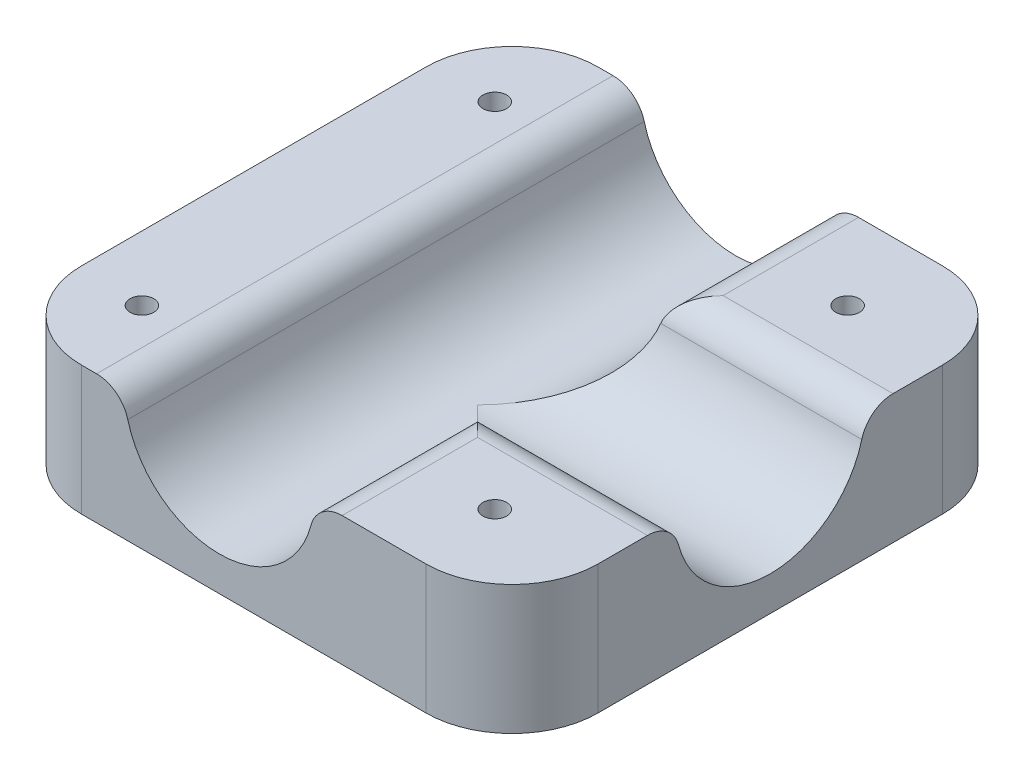
ISO-10303-21;
HEADER;
FILE_DESCRIPTION(('STEP AP214'),'2;1');
FILE_NAME('part.step','',(''),(''),'','','');
FILE_SCHEMA(('AUTOMOTIVE_DESIGN { 1 0 10303 214 1 1 1 1 }'));
ENDSEC;
DATA;
#1=APPLICATION_CONTEXT('core data for automotive mechanical design processes');
#2=APPLICATION_PROTOCOL_DEFINITION('international standard','automotive_design',2000,#1);
#3=PRODUCT_CONTEXT('',#1,'mechanical');
#4=PRODUCT('Part','Part','',(#3));
#5=PRODUCT_RELATED_PRODUCT_CATEGORY('part','',(#4));
#6=PRODUCT_DEFINITION_FORMATION('','',#4);
#7=PRODUCT_DEFINITION_CONTEXT('part definition',#1,'design');
#8=PRODUCT_DEFINITION('design','',#6,#7);
#9=PRODUCT_DEFINITION_SHAPE('','',#8);
#10=(LENGTH_UNIT() NAMED_UNIT(*) SI_UNIT(.MILLI.,.METRE.));
#11=(NAMED_UNIT(*) PLANE_ANGLE_UNIT() SI_UNIT($,.RADIAN.));
#12=(NAMED_UNIT(*) SI_UNIT($,.STERADIAN.) SOLID_ANGLE_UNIT());
#13=UNCERTAINTY_MEASURE_WITH_UNIT(LENGTH_MEASURE(1.E-05),#10,'distance_accuracy_value','');
#14=(GEOMETRIC_REPRESENTATION_CONTEXT(3) GLOBAL_UNCERTAINTY_ASSIGNED_CONTEXT((#13)) GLOBAL_UNIT_ASSIGNED_CONTEXT((#10,
#11,#12)) REPRESENTATION_CONTEXT('',''));
#15=CARTESIAN_POINT('',(0.,0.,0.));
#16=DIRECTION('',(0.,0.,1.));
#17=DIRECTION('',(1.,0.,0.));
#18=AXIS2_PLACEMENT_3D('',#15,#16,#17);
#19=CARTESIAN_POINT('',(0.,19.05,0.));
#20=DIRECTION('',(0.,1.,0.));
#21=DIRECTION('',(0.,0.,1.));
#22=AXIS2_PLACEMENT_3D('',#19,#20,#21);
#23=PLANE('',#22);
#24=DIRECTION('',(1.,0.,0.));
#25=VECTOR('',#24,1.);
#26=CARTESIAN_POINT('',(0.,19.05,0.));
#27=LINE('',#26,#25);
#28=CARTESIAN_POINT('',(51.1369851244626,19.05,0.));
#29=VERTEX_POINT('',#28);
#30=CARTESIAN_POINT('',(63.5,19.05,0.));
#31=VERTEX_POINT('',#30);
#32=EDGE_CURVE('E235',#29,#31,#27,.T.);
#33=ORIENTED_EDGE('',*,*,#32,.T.);
#34=CARTESIAN_POINT('',(63.5,19.05,-12.7));
#35=DIRECTION('',(0.,1.,0.));
#36=DIRECTION('',(0.,0.,1.));
#37=AXIS2_PLACEMENT_3D('',#34,#35,#36);
#38=CIRCLE('',#37,12.7);
#39=CARTESIAN_POINT('',(76.2,19.05,-12.7));
#40=VERTEX_POINT('',#39);
#41=EDGE_CURVE('E11',#31,#40,#38,.T.);
#42=ORIENTED_EDGE('',*,*,#41,.T.);
#43=DIRECTION('',(0.,0.,-1.));
#44=VECTOR('',#43,1.);
#45=CARTESIAN_POINT('',(76.2,19.05,0.));
#46=LINE('',#45,#44);
#47=CARTESIAN_POINT('',(76.2,19.05,-19.9830148755374));
#48=VERTEX_POINT('',#47);
#49=EDGE_CURVE('E240',#40,#48,#46,.T.);
#50=ORIENTED_EDGE('',*,*,#49,.T.);
#51=DIRECTION('',(-1.,0.,0.));
#52=VECTOR('',#51,1.);
#53=CARTESIAN_POINT('',(46.99,19.05,-19.9830148755374));
#54=LINE('',#53,#52);
#55=CARTESIAN_POINT('',(51.1369851244626,19.05,-19.9830148755374));
#56=VERTEX_POINT('',#55);
#57=EDGE_CURVE('E296',#48,#56,#54,.T.);
#58=ORIENTED_EDGE('',*,*,#57,.T.);
#59=DIRECTION('',(0.,0.,-1.));
#60=VECTOR('',#59,1.);
#61=CARTESIAN_POINT('',(51.1369851244626,19.05,0.));
#62=LINE('',#61,#60);
#63=EDGE_CURVE('E299',#56,#29,#62,.F.);
#64=ORIENTED_EDGE('',*,*,#63,.T.);
#65=EDGE_LOOP('',(#33,#42,#50,#58,#64));
#66=FACE_BOUND('',#65,.T.);
#67=CARTESIAN_POINT('',(61.595,19.05,-12.065));
#68=DIRECTION('',(0.,1.,0.));
#69=DIRECTION('',(0.,0.,1.));
#70=AXIS2_PLACEMENT_3D('',#67,#68,#69);
#71=CIRCLE('',#70,1.75);
#72=CARTESIAN_POINT('',(61.595,19.05,-10.315));
#73=VERTEX_POINT('',#72);
#74=EDGE_CURVE('E251',#73,#73,#71,.T.);
#75=ORIENTED_EDGE('',*,*,#74,.F.);
#76=EDGE_LOOP('',(#75));
#77=FACE_BOUND('',#76,.T.);
#78=ADVANCED_FACE('F41',(#66,#77),#23,.T.);
#79=DIRECTION('',(1.,0.,0.));
#80=VECTOR('',#79,1.);
#81=CARTESIAN_POINT('',(0.,19.05,-76.2));
#82=LINE('',#81,#80);
#83=CARTESIAN_POINT('',(12.7,19.05,-76.2));
#84=VERTEX_POINT('',#83);
#85=CARTESIAN_POINT('',(14.9030148755374,19.05,-76.2));
#86=VERTEX_POINT('',#85);
#87=EDGE_CURVE('E244',#84,#86,#82,.T.);
#88=ORIENTED_EDGE('',*,*,#87,.F.);
#89=CARTESIAN_POINT('',(12.7,19.05,-63.5));
#90=DIRECTION('',(0.,1.,0.));
#91=DIRECTION('',(0.,0.,1.));
#92=AXIS2_PLACEMENT_3D('',#89,#90,#91);
#93=CIRCLE('',#92,12.7);
#94=CARTESIAN_POINT('',(0.,19.05,-63.5));
#95=VERTEX_POINT('',#94);
#96=EDGE_CURVE('E381',#84,#95,#93,.T.);
#97=ORIENTED_EDGE('',*,*,#96,.T.);
#98=DIRECTION('',(0.,0.,-1.));
#99=VECTOR('',#98,1.);
#100=CARTESIAN_POINT('',(0.,19.05,0.));
#101=LINE('',#100,#99);
#102=CARTESIAN_POINT('',(0.,19.05,-12.7));
#103=VERTEX_POINT('',#102);
#104=EDGE_CURVE('E247',#103,#95,#101,.T.);
#105=ORIENTED_EDGE('',*,*,#104,.F.);
#106=CARTESIAN_POINT('',(12.7,19.05,-12.7));
#107=DIRECTION('',(0.,1.,0.));
#108=DIRECTION('',(0.,0.,1.));
#109=AXIS2_PLACEMENT_3D('',#106,#107,#108);
#110=CIRCLE('',#109,12.7);
#111=CARTESIAN_POINT('',(12.7,19.05,0.));
#112=VERTEX_POINT('',#111);
#113=EDGE_CURVE('E70',#103,#112,#110,.T.);
#114=ORIENTED_EDGE('',*,*,#113,.T.);
#115=CARTESIAN_POINT('',(14.9030148755374,19.05,0.));
#116=VERTEX_POINT('',#115);
#117=EDGE_CURVE('E236',#112,#116,#27,.T.);
#118=ORIENTED_EDGE('',*,*,#117,.T.);
#119=DIRECTION('',(0.,0.,-1.));
#120=VECTOR('',#119,1.);
#121=CARTESIAN_POINT('',(14.9030148755374,19.05,-76.2));
#122=LINE('',#121,#120);
#123=EDGE_CURVE('E334',#116,#86,#122,.T.);
#124=ORIENTED_EDGE('',*,*,#123,.T.);
#125=EDGE_LOOP('',(#88,#97,#105,#114,#118,#124));
#126=FACE_BOUND('',#125,.T.);
#127=CARTESIAN_POINT('',(9.525,19.05,-64.135));
#128=DIRECTION('',(0.,1.,0.));
#129=DIRECTION('',(0.,0.,1.));
#130=AXIS2_PLACEMENT_3D('',#127,#128,#129);
#131=CIRCLE('',#130,1.75);
#132=CARTESIAN_POINT('',(9.525,19.05,-62.385));
#133=VERTEX_POINT('',#132);
#134=EDGE_CURVE('E230',#133,#133,#131,.T.);
#135=ORIENTED_EDGE('',*,*,#134,.F.);
#136=EDGE_LOOP('',(#135));
#137=FACE_BOUND('',#136,.T.);
#138=CARTESIAN_POINT('',(9.525,19.05,-12.065));
#139=DIRECTION('',(0.,1.,0.));
#140=DIRECTION('',(0.,0.,1.));
#141=AXIS2_PLACEMENT_3D('',#138,#139,#140);
#142=CIRCLE('',#141,1.75);
#143=CARTESIAN_POINT('',(9.525,19.05,-10.315));
#144=VERTEX_POINT('',#143);
#145=EDGE_CURVE('E226',#144,#144,#142,.T.);
#146=ORIENTED_EDGE('',*,*,#145,.F.);
#147=EDGE_LOOP('',(#146));
#148=FACE_BOUND('',#147,.T.);
#149=ADVANCED_FACE('F437',(#126,#137,#148),#23,.T.);
#150=CARTESIAN_POINT('',(0.,19.05,0.));
#151=DIRECTION('',(0.,0.,-1.));
#152=DIRECTION('',(-1.,0.,0.));
#153=AXIS2_PLACEMENT_3D('',#150,#151,#152);
#154=PLANE('',#153);
#155=ORIENTED_EDGE('',*,*,#117,.F.);
#156=DIRECTION('',(0.,-1.,0.));
#157=VECTOR('',#156,1.);
#158=CARTESIAN_POINT('',(12.7,0.,0.));
#159=LINE('',#158,#157);
#160=CARTESIAN_POINT('',(12.7,0.,0.));
#161=VERTEX_POINT('',#160);
#162=EDGE_CURVE('E50',#112,#161,#159,.T.);
#163=ORIENTED_EDGE('',*,*,#162,.T.);
#164=DIRECTION('',(1.,0.,0.));
#165=VECTOR('',#164,1.);
#166=CARTESIAN_POINT('',(0.,0.,0.));
#167=LINE('',#166,#165);
#168=CARTESIAN_POINT('',(63.5,0.,0.));
#169=VERTEX_POINT('',#168);
#170=EDGE_CURVE('E267',#161,#169,#167,.T.);
#171=ORIENTED_EDGE('',*,*,#170,.T.);
#172=DIRECTION('',(0.,-1.,0.));
#173=VECTOR('',#172,1.);
#174=CARTESIAN_POINT('',(63.5,19.05,0.));
#175=LINE('',#174,#173);
#176=EDGE_CURVE('E59',#169,#31,#175,.F.);
#177=ORIENTED_EDGE('',*,*,#176,.T.);
#178=ORIENTED_EDGE('',*,*,#32,.F.);
#179=CARTESIAN_POINT('',(51.1369851244626,14.2875,0.));
#180=DIRECTION('',(0.,0.,-1.));
#181=DIRECTION('',(-1.,0.,0.));
#182=AXIS2_PLACEMENT_3D('',#179,#180,#181);
#183=CIRCLE('',#182,4.7625);
#184=CARTESIAN_POINT('',(46.5309719572264,15.4983050847458,0.));
#185=VERTEX_POINT('',#184);
#186=EDGE_CURVE('E306',#29,#185,#183,.F.);
#187=ORIENTED_EDGE('',*,*,#186,.T.);
#188=CARTESIAN_POINT('',(33.02,19.05,0.));
#189=DIRECTION('',(0.,0.,1.));
#190=DIRECTION('',(1.,0.,0.));
#191=AXIS2_PLACEMENT_3D('',#188,#189,#190);
#192=CIRCLE('',#191,13.97);
#193=CARTESIAN_POINT('',(19.5090280427736,15.4983050847458,0.));
#194=VERTEX_POINT('',#193);
#195=EDGE_CURVE('E203',#194,#185,#192,.T.);
#196=ORIENTED_EDGE('',*,*,#195,.F.);
#197=CARTESIAN_POINT('',(14.9030148755374,14.2875,0.));
#198=DIRECTION('',(0.,0.,-1.));
#199=DIRECTION('',(-1.,0.,0.));
#200=AXIS2_PLACEMENT_3D('',#197,#198,#199);
#201=CIRCLE('',#200,4.7625);
#202=EDGE_CURVE('E302',#194,#116,#201,.F.);
#203=ORIENTED_EDGE('',*,*,#202,.T.);
#204=EDGE_LOOP('',(#155,#163,#171,#177,#178,#187,#196,#203));
#205=FACE_BOUND('',#204,.T.);
#206=ADVANCED_FACE('F389',(#205),#154,.F.);
#207=CARTESIAN_POINT('',(76.2,19.05,0.));
#208=DIRECTION('',(-1.,0.,0.));
#209=DIRECTION('',(0.,0.,1.));
#210=AXIS2_PLACEMENT_3D('',#207,#208,#209);
#211=PLANE('',#210);
#212=DIRECTION('',(0.,0.,-1.));
#213=VECTOR('',#212,1.);
#214=CARTESIAN_POINT('',(76.2,0.,0.));
#215=LINE('',#214,#213);
#216=CARTESIAN_POINT('',(76.2,0.,-12.7));
#217=VERTEX_POINT('',#216);
#218=CARTESIAN_POINT('',(76.2,0.,-63.5));
#219=VERTEX_POINT('',#218);
#220=EDGE_CURVE('E270',#217,#219,#215,.T.);
#221=ORIENTED_EDGE('',*,*,#220,.T.);
#222=DIRECTION('',(0.,-1.,0.));
#223=VECTOR('',#222,1.);
#224=CARTESIAN_POINT('',(76.2,19.05,-63.5));
#225=LINE('',#224,#223);
#226=CARTESIAN_POINT('',(76.2,19.05,-63.5));
#227=VERTEX_POINT('',#226);
#228=EDGE_CURVE('E367',#219,#227,#225,.F.);
#229=ORIENTED_EDGE('',*,*,#228,.T.);
#230=CARTESIAN_POINT('',(76.2,19.05,-56.2169851244626));
#231=VERTEX_POINT('',#230);
#232=EDGE_CURVE('E239',#231,#227,#46,.T.);
#233=ORIENTED_EDGE('',*,*,#232,.F.);
#234=CARTESIAN_POINT('',(76.2,14.2875,-56.2169851244626));
#235=DIRECTION('',(-1.,0.,0.));
#236=DIRECTION('',(0.,0.,1.));
#237=AXIS2_PLACEMENT_3D('',#234,#235,#236);
#238=CIRCLE('',#237,4.7625);
#239=CARTESIAN_POINT('',(76.2,15.4983050847458,-51.6109719572264));
#240=VERTEX_POINT('',#239);
#241=EDGE_CURVE('E314',#231,#240,#238,.F.);
#242=ORIENTED_EDGE('',*,*,#241,.T.);
#243=CARTESIAN_POINT('',(76.2,19.05,-38.1));
#244=DIRECTION('',(1.,0.,0.));
#245=DIRECTION('',(0.,0.,-1.));
#246=AXIS2_PLACEMENT_3D('',#243,#244,#245);
#247=CIRCLE('',#246,13.97);
#248=CARTESIAN_POINT('',(76.2,15.4983050847458,-24.5890280427736));
#249=VERTEX_POINT('',#248);
#250=EDGE_CURVE('E211',#249,#240,#247,.T.);
#251=ORIENTED_EDGE('',*,*,#250,.F.);
#252=CARTESIAN_POINT('',(76.2,14.2875,-19.9830148755374));
#253=DIRECTION('',(-1.,0.,0.));
#254=DIRECTION('',(0.,0.,1.));
#255=AXIS2_PLACEMENT_3D('',#252,#253,#254);
#256=CIRCLE('',#255,4.7625);
#257=EDGE_CURVE('E317',#249,#48,#256,.F.);
#258=ORIENTED_EDGE('',*,*,#257,.T.);
#259=ORIENTED_EDGE('',*,*,#49,.F.);
#260=DIRECTION('',(0.,-1.,0.));
#261=VECTOR('',#260,1.);
#262=CARTESIAN_POINT('',(76.2,19.05,-12.7));
#263=LINE('',#262,#261);
#264=EDGE_CURVE('E363',#40,#217,#263,.T.);
#265=ORIENTED_EDGE('',*,*,#264,.T.);
#266=EDGE_LOOP('',(#221,#229,#233,#242,#251,#258,#259,#265));
#267=FACE_BOUND('',#266,.T.);
#268=ADVANCED_FACE('F401',(#267),#211,.F.);
#269=CARTESIAN_POINT('',(0.,19.05,-76.2));
#270=DIRECTION('',(0.,0.,-1.));
#271=DIRECTION('',(-1.,0.,0.));
#272=AXIS2_PLACEMENT_3D('',#269,#270,#271);
#273=PLANE('',#272);
#274=CARTESIAN_POINT('',(51.1369851244626,19.05,-76.2));
#275=VERTEX_POINT('',#274);
#276=CARTESIAN_POINT('',(63.5,19.05,-76.2));
#277=VERTEX_POINT('',#276);
#278=EDGE_CURVE('E243',#275,#277,#82,.T.);
#279=ORIENTED_EDGE('',*,*,#278,.T.);
#280=DIRECTION('',(0.,-1.,0.));
#281=VECTOR('',#280,1.);
#282=CARTESIAN_POINT('',(63.5,0.,-76.2));
#283=LINE('',#282,#281);
#284=CARTESIAN_POINT('',(63.5,0.,-76.2));
#285=VERTEX_POINT('',#284);
#286=EDGE_CURVE('E347',#277,#285,#283,.T.);
#287=ORIENTED_EDGE('',*,*,#286,.T.);
#288=DIRECTION('',(1.,0.,0.));
#289=VECTOR('',#288,1.);
#290=CARTESIAN_POINT('',(0.,0.,-76.2));
#291=LINE('',#290,#289);
#292=CARTESIAN_POINT('',(12.7,0.,-76.2));
#293=VERTEX_POINT('',#292);
#294=EDGE_CURVE('E274',#293,#285,#291,.T.);
#295=ORIENTED_EDGE('',*,*,#294,.F.);
#296=DIRECTION('',(0.,-1.,0.));
#297=VECTOR('',#296,1.);
#298=CARTESIAN_POINT('',(12.7,19.05,-76.2));
#299=LINE('',#298,#297);
#300=EDGE_CURVE('E338',#293,#84,#299,.F.);
#301=ORIENTED_EDGE('',*,*,#300,.T.);
#302=ORIENTED_EDGE('',*,*,#87,.T.);
#303=CARTESIAN_POINT('',(14.9030148755374,14.2875,-76.2));
#304=DIRECTION('',(0.,0.,-1.));
#305=DIRECTION('',(-1.,0.,0.));
#306=AXIS2_PLACEMENT_3D('',#303,#304,#305);
#307=CIRCLE('',#306,4.7625);
#308=CARTESIAN_POINT('',(19.5090280427736,15.4983050847458,-76.2));
#309=VERTEX_POINT('',#308);
#310=EDGE_CURVE('E328',#86,#309,#307,.T.);
#311=ORIENTED_EDGE('',*,*,#310,.T.);
#312=CARTESIAN_POINT('',(33.02,19.05,-76.2));
#313=DIRECTION('',(0.,0.,1.));
#314=DIRECTION('',(1.,0.,0.));
#315=AXIS2_PLACEMENT_3D('',#312,#313,#314);
#316=CIRCLE('',#315,13.97);
#317=CARTESIAN_POINT('',(46.5309719572264,15.4983050847458,-76.2));
#318=VERTEX_POINT('',#317);
#319=EDGE_CURVE('E219',#309,#318,#316,.T.);
#320=ORIENTED_EDGE('',*,*,#319,.T.);
#321=CARTESIAN_POINT('',(51.1369851244626,14.2875,-76.2));
#322=DIRECTION('',(0.,0.,-1.));
#323=DIRECTION('',(-1.,0.,0.));
#324=AXIS2_PLACEMENT_3D('',#321,#322,#323);
#325=CIRCLE('',#324,4.7625);
#326=EDGE_CURVE('E331',#318,#275,#325,.T.);
#327=ORIENTED_EDGE('',*,*,#326,.T.);
#328=EDGE_LOOP('',(#279,#287,#295,#301,#302,#311,#320,#327));
#329=FACE_BOUND('',#328,.T.);
#330=ADVANCED_FACE('F427',(#329),#273,.T.);
#331=CARTESIAN_POINT('',(61.595,19.05,-12.065));
#332=DIRECTION('',(0.,-1.,0.));
#333=DIRECTION('',(0.,0.,-1.));
#334=AXIS2_PLACEMENT_3D('',#331,#332,#333);
#335=CYLINDRICAL_SURFACE('',#334,1.75);
#336=ORIENTED_EDGE('',*,*,#74,.T.);
#337=EDGE_LOOP('',(#336));
#338=FACE_BOUND('',#337,.T.);
#339=CARTESIAN_POINT('',(61.595,0.,-12.065));
#340=DIRECTION('',(0.,1.,0.));
#341=DIRECTION('',(0.,0.,1.));
#342=AXIS2_PLACEMENT_3D('',#339,#340,#341);
#343=CIRCLE('',#342,1.75);
#344=CARTESIAN_POINT('',(61.595,0.,-10.315));
#345=VERTEX_POINT('',#344);
#346=EDGE_CURVE('E282',#345,#345,#343,.T.);
#347=ORIENTED_EDGE('',*,*,#346,.F.);
#348=EDGE_LOOP('',(#347));
#349=FACE_BOUND('',#348,.T.);
#350=ADVANCED_FACE('F471',(#338,#349),#335,.F.);
#351=CARTESIAN_POINT('',(0.,19.05,0.));
#352=DIRECTION('',(-1.,0.,0.));
#353=DIRECTION('',(0.,0.,1.));
#354=AXIS2_PLACEMENT_3D('',#351,#352,#353);
#355=PLANE('',#354);
#356=ORIENTED_EDGE('',*,*,#104,.T.);
#357=DIRECTION('',(0.,-1.,0.));
#358=VECTOR('',#357,1.);
#359=CARTESIAN_POINT('',(0.,19.05,-63.5));
#360=LINE('',#359,#358);
#361=CARTESIAN_POINT('',(0.,0.,-63.5));
#362=VERTEX_POINT('',#361);
#363=EDGE_CURVE('E376',#95,#362,#360,.T.);
#364=ORIENTED_EDGE('',*,*,#363,.T.);
#365=DIRECTION('',(0.,0.,-1.));
#366=VECTOR('',#365,1.);
#367=CARTESIAN_POINT('',(0.,0.,0.));
#368=LINE('',#367,#366);
#369=CARTESIAN_POINT('',(0.,0.,-12.7));
#370=VERTEX_POINT('',#369);
#371=EDGE_CURVE('E278',#370,#362,#368,.T.);
#372=ORIENTED_EDGE('',*,*,#371,.F.);
#373=DIRECTION('',(0.,-1.,0.));
#374=VECTOR('',#373,1.);
#375=CARTESIAN_POINT('',(0.,19.05,-12.7));
#376=LINE('',#375,#374);
#377=EDGE_CURVE('E373',#370,#103,#376,.F.);
#378=ORIENTED_EDGE('',*,*,#377,.T.);
#379=EDGE_LOOP('',(#356,#364,#372,#378));
#380=FACE_BOUND('',#379,.T.);
#381=ADVANCED_FACE('F434',(#380),#355,.T.);
#382=CARTESIAN_POINT('',(9.525,19.05,-64.135));
#383=DIRECTION('',(0.,-1.,0.));
#384=DIRECTION('',(0.,0.,-1.));
#385=AXIS2_PLACEMENT_3D('',#382,#383,#384);
#386=CYLINDRICAL_SURFACE('',#385,1.75);
#387=ORIENTED_EDGE('',*,*,#134,.T.);
#388=EDGE_LOOP('',(#387));
#389=FACE_BOUND('',#388,.T.);
#390=CARTESIAN_POINT('',(9.525,0.,-64.135));
#391=DIRECTION('',(0.,1.,0.));
#392=DIRECTION('',(0.,0.,1.));
#393=AXIS2_PLACEMENT_3D('',#390,#391,#392);
#394=CIRCLE('',#393,1.75);
#395=CARTESIAN_POINT('',(9.525,0.,-62.385));
#396=VERTEX_POINT('',#395);
#397=EDGE_CURVE('E263',#396,#396,#394,.T.);
#398=ORIENTED_EDGE('',*,*,#397,.F.);
#399=EDGE_LOOP('',(#398));
#400=FACE_BOUND('',#399,.T.);
#401=ADVANCED_FACE('F466',(#389,#400),#386,.F.);
#402=CARTESIAN_POINT('',(9.525,19.05,-12.065));
#403=DIRECTION('',(0.,-1.,0.));
#404=DIRECTION('',(0.,0.,-1.));
#405=AXIS2_PLACEMENT_3D('',#402,#403,#404);
#406=CYLINDRICAL_SURFACE('',#405,1.75);
#407=ORIENTED_EDGE('',*,*,#145,.T.);
#408=EDGE_LOOP('',(#407));
#409=FACE_BOUND('',#408,.T.);
#410=CARTESIAN_POINT('',(9.525,0.,-12.065));
#411=DIRECTION('',(0.,1.,0.));
#412=DIRECTION('',(0.,0.,1.));
#413=AXIS2_PLACEMENT_3D('',#410,#411,#412);
#414=CIRCLE('',#413,1.75);
#415=CARTESIAN_POINT('',(9.525,0.,-10.315));
#416=VERTEX_POINT('',#415);
#417=EDGE_CURVE('E223',#416,#416,#414,.T.);
#418=ORIENTED_EDGE('',*,*,#417,.F.);
#419=EDGE_LOOP('',(#418));
#420=FACE_BOUND('',#419,.T.);
#421=ADVANCED_FACE('F460',(#409,#420),#406,.F.);
#422=CARTESIAN_POINT('',(61.595,19.05,-64.135));
#423=DIRECTION('',(0.,-1.,0.));
#424=DIRECTION('',(0.,0.,-1.));
#425=AXIS2_PLACEMENT_3D('',#422,#423,#424);
#426=CYLINDRICAL_SURFACE('',#425,1.74999999999999);
#427=CARTESIAN_POINT('',(61.595,19.05,-64.135));
#428=DIRECTION('',(0.,1.,0.));
#429=DIRECTION('',(0.,0.,1.));
#430=AXIS2_PLACEMENT_3D('',#427,#428,#429);
#431=CIRCLE('',#430,1.74999999999999);
#432=CARTESIAN_POINT('',(61.595,19.05,-62.385));
#433=VERTEX_POINT('',#432);
#434=EDGE_CURVE('E255',#433,#433,#431,.T.);
#435=ORIENTED_EDGE('',*,*,#434,.T.);
#436=EDGE_LOOP('',(#435));
#437=FACE_BOUND('',#436,.T.);
#438=CARTESIAN_POINT('',(61.595,0.,-64.135));
#439=DIRECTION('',(0.,1.,0.));
#440=DIRECTION('',(0.,0.,1.));
#441=AXIS2_PLACEMENT_3D('',#438,#439,#440);
#442=CIRCLE('',#441,1.74999999999999);
#443=CARTESIAN_POINT('',(61.595,0.,-62.385));
#444=VERTEX_POINT('',#443);
#445=EDGE_CURVE('E231',#444,#444,#442,.T.);
#446=ORIENTED_EDGE('',*,*,#445,.F.);
#447=EDGE_LOOP('',(#446));
#448=FACE_BOUND('',#447,.T.);
#449=ADVANCED_FACE('F454',(#437,#448),#426,.F.);
#450=ORIENTED_EDGE('',*,*,#232,.T.);
#451=CARTESIAN_POINT('',(63.5,19.05,-63.5));
#452=DIRECTION('',(0.,1.,0.));
#453=DIRECTION('',(0.,0.,1.));
#454=AXIS2_PLACEMENT_3D('',#451,#452,#453);
#455=CIRCLE('',#454,12.7);
#456=EDGE_CURVE('E370',#227,#277,#455,.T.);
#457=ORIENTED_EDGE('',*,*,#456,.T.);
#458=ORIENTED_EDGE('',*,*,#278,.F.);
#459=DIRECTION('',(0.,0.,-1.));
#460=VECTOR('',#459,1.);
#461=CARTESIAN_POINT('',(51.1369851244626,19.05,-52.07));
#462=LINE('',#461,#460);
#463=CARTESIAN_POINT('',(51.1369851244626,19.05,-56.2169851244626));
#464=VERTEX_POINT('',#463);
#465=EDGE_CURVE('E321',#275,#464,#462,.F.);
#466=ORIENTED_EDGE('',*,*,#465,.T.);
#467=DIRECTION('',(-1.,0.,0.));
#468=VECTOR('',#467,1.);
#469=CARTESIAN_POINT('',(76.2,19.05,-56.2169851244626));
#470=LINE('',#469,#468);
#471=EDGE_CURVE('E324',#464,#231,#470,.F.);
#472=ORIENTED_EDGE('',*,*,#471,.T.);
#473=EDGE_LOOP('',(#450,#457,#458,#466,#472));
#474=FACE_BOUND('',#473,.T.);
#475=ORIENTED_EDGE('',*,*,#434,.F.);
#476=EDGE_LOOP('',(#475));
#477=FACE_BOUND('',#476,.T.);
#478=ADVANCED_FACE('F418',(#474,#477),#23,.T.);
#479=CARTESIAN_POINT('',(0.,0.,0.));
#480=DIRECTION('',(0.,1.,0.));
#481=DIRECTION('',(0.,0.,1.));
#482=AXIS2_PLACEMENT_3D('',#479,#480,#481);
#483=PLANE('',#482);
#484=ORIENTED_EDGE('',*,*,#417,.T.);
#485=EDGE_LOOP('',(#484));
#486=FACE_BOUND('',#485,.T.);
#487=ORIENTED_EDGE('',*,*,#397,.T.);
#488=EDGE_LOOP('',(#487));
#489=FACE_BOUND('',#488,.T.);
#490=ORIENTED_EDGE('',*,*,#294,.T.);
#491=CARTESIAN_POINT('',(63.5,0.,-63.5));
#492=DIRECTION('',(0.,1.,0.));
#493=DIRECTION('',(0.,0.,1.));
#494=AXIS2_PLACEMENT_3D('',#491,#492,#493);
#495=CIRCLE('',#494,12.7);
#496=EDGE_CURVE('E360',#285,#219,#495,.F.);
#497=ORIENTED_EDGE('',*,*,#496,.T.);
#498=ORIENTED_EDGE('',*,*,#220,.F.);
#499=CARTESIAN_POINT('',(63.5,0.,-12.7));
#500=DIRECTION('',(0.,1.,0.));
#501=DIRECTION('',(0.,0.,1.));
#502=AXIS2_PLACEMENT_3D('',#499,#500,#501);
#503=CIRCLE('',#502,12.7);
#504=EDGE_CURVE('E351',#217,#169,#503,.F.);
#505=ORIENTED_EDGE('',*,*,#504,.T.);
#506=ORIENTED_EDGE('',*,*,#170,.F.);
#507=CARTESIAN_POINT('',(12.7,0.,-12.7));
#508=DIRECTION('',(0.,1.,0.));
#509=DIRECTION('',(0.,0.,1.));
#510=AXIS2_PLACEMENT_3D('',#507,#508,#509);
#511=CIRCLE('',#510,12.7);
#512=EDGE_CURVE('E354',#161,#370,#511,.F.);
#513=ORIENTED_EDGE('',*,*,#512,.T.);
#514=ORIENTED_EDGE('',*,*,#371,.T.);
#515=CARTESIAN_POINT('',(12.7,0.,-63.5));
#516=DIRECTION('',(0.,1.,0.));
#517=DIRECTION('',(0.,0.,1.));
#518=AXIS2_PLACEMENT_3D('',#515,#516,#517);
#519=CIRCLE('',#518,12.7);
#520=EDGE_CURVE('E357',#362,#293,#519,.F.);
#521=ORIENTED_EDGE('',*,*,#520,.T.);
#522=EDGE_LOOP('',(#490,#497,#498,#505,#506,#513,#514,#521));
#523=FACE_BOUND('',#522,.T.);
#524=ORIENTED_EDGE('',*,*,#346,.T.);
#525=EDGE_LOOP('',(#524));
#526=FACE_BOUND('',#525,.T.);
#527=ORIENTED_EDGE('',*,*,#445,.T.);
#528=EDGE_LOOP('',(#527));
#529=FACE_BOUND('',#528,.T.);
#530=ADVANCED_FACE('F392',(#486,#489,#523,#526,#529),#483,.F.);
#531=CARTESIAN_POINT('',(33.02,19.05,-76.2));
#532=DIRECTION('',(0.,0.,1.));
#533=DIRECTION('',(1.,0.,0.));
#534=AXIS2_PLACEMENT_3D('',#531,#532,#533);
#535=CYLINDRICAL_SURFACE('',#534,13.97);
#536=ORIENTED_EDGE('',*,*,#195,.T.);
#537=DIRECTION('',(0.,0.,1.));
#538=VECTOR('',#537,1.);
#539=CARTESIAN_POINT('',(46.5309719572264,15.4983050847458,-76.2));
#540=LINE('',#539,#538);
#541=CARTESIAN_POINT('',(46.5309719572264,15.4983050847458,-24.5890280427736));
#542=VERTEX_POINT('',#541);
#543=EDGE_CURVE('E209',#185,#542,#540,.F.);
#544=ORIENTED_EDGE('',*,*,#543,.T.);
#545=CARTESIAN_POINT('',(33.02,19.05,-38.1));
#546=DIRECTION('',(0.707106781186547,0.,-0.707106781186548));
#547=DIRECTION('',(0.707106781186548,0.,0.707106781186547));
#548=AXIS2_PLACEMENT_3D('',#545,#546,#547);
#549=ELLIPSE('',#548,19.7565634663521,13.97);
#550=CARTESIAN_POINT('',(33.02,5.08,-38.1));
#551=VERTEX_POINT('',#550);
#552=EDGE_CURVE('E196',#551,#542,#549,.F.);
#553=ORIENTED_EDGE('',*,*,#552,.F.);
#554=CARTESIAN_POINT('',(33.02,19.05,-38.1));
#555=DIRECTION('',(0.707106781186548,0.,0.707106781186547));
#556=DIRECTION('',(0.707106781186547,0.,-0.707106781186548));
#557=AXIS2_PLACEMENT_3D('',#554,#555,#556);
#558=ELLIPSE('',#557,19.7565634663521,13.97);
#559=CARTESIAN_POINT('',(46.5309719572264,15.4983050847458,-51.6109719572264));
#560=VERTEX_POINT('',#559);
#561=EDGE_CURVE('E193',#560,#551,#558,.F.);
#562=ORIENTED_EDGE('',*,*,#561,.F.);
#563=DIRECTION('',(0.,0.,1.));
#564=VECTOR('',#563,1.);
#565=CARTESIAN_POINT('',(46.5309719572264,15.4983050847458,-76.2));
#566=LINE('',#565,#564);
#567=EDGE_CURVE('E292',#560,#318,#566,.F.);
#568=ORIENTED_EDGE('',*,*,#567,.T.);
#569=ORIENTED_EDGE('',*,*,#319,.F.);
#570=DIRECTION('',(0.,0.,1.));
#571=VECTOR('',#570,1.);
#572=CARTESIAN_POINT('',(19.5090280427736,15.4983050847458,-76.2));
#573=LINE('',#572,#571);
#574=EDGE_CURVE('E259',#309,#194,#573,.T.);
#575=ORIENTED_EDGE('',*,*,#574,.T.);
#576=EDGE_LOOP('',(#536,#544,#553,#562,#568,#569,#575));
#577=FACE_BOUND('',#576,.T.);
#578=ADVANCED_FACE('F207',(#577),#535,.F.);
#579=CARTESIAN_POINT('',(-0.00100000000001488,19.05,-38.1));
#580=DIRECTION('',(1.,0.,0.));
#581=DIRECTION('',(0.,0.,-1.));
#582=AXIS2_PLACEMENT_3D('',#579,#580,#581);
#583=CYLINDRICAL_SURFACE('',#582,13.97);
#584=ORIENTED_EDGE('',*,*,#552,.T.);
#585=DIRECTION('',(1.,0.,0.));
#586=VECTOR('',#585,1.);
#587=CARTESIAN_POINT('',(-0.0010000000000116,15.4983050847458,-24.5890280427736));
#588=LINE('',#587,#586);
#589=EDGE_CURVE('E311',#542,#249,#588,.T.);
#590=ORIENTED_EDGE('',*,*,#589,.T.);
#591=ORIENTED_EDGE('',*,*,#250,.T.);
#592=DIRECTION('',(1.,0.,0.));
#593=VECTOR('',#592,1.);
#594=CARTESIAN_POINT('',(-0.00100000000001816,15.4983050847458,-51.6109719572263));
#595=LINE('',#594,#593);
#596=EDGE_CURVE('E199',#240,#560,#595,.F.);
#597=ORIENTED_EDGE('',*,*,#596,.T.);
#598=ORIENTED_EDGE('',*,*,#561,.T.);
#599=EDGE_LOOP('',(#584,#590,#591,#597,#598));
#600=FACE_BOUND('',#599,.T.);
#601=ADVANCED_FACE('F195',(#600),#583,.F.);
#602=CARTESIAN_POINT('',(-0.00100000000001048,14.2875,-19.9830148755374));
#603=DIRECTION('',(1.,0.,0.));
#604=DIRECTION('',(0.,0.,-1.));
#605=AXIS2_PLACEMENT_3D('',#602,#603,#604);
#606=CYLINDRICAL_SURFACE('',#605,4.7625);
#607=ORIENTED_EDGE('',*,*,#257,.F.);
#608=ORIENTED_EDGE('',*,*,#589,.F.);
#609=CARTESIAN_POINT('',(51.1369851244626,14.2875,-19.9830148755374));
#610=DIRECTION('',(0.707106781186547,0.,-0.707106781186548));
#611=DIRECTION('',(0.707106781186548,0.,0.707106781186547));
#612=AXIS2_PLACEMENT_3D('',#609,#610,#611);
#613=ELLIPSE('',#612,6.73519209080187,4.7625);
#614=EDGE_CURVE('E216',#56,#542,#613,.F.);
#615=ORIENTED_EDGE('',*,*,#614,.F.);
#616=ORIENTED_EDGE('',*,*,#57,.F.);
#617=EDGE_LOOP('',(#607,#608,#615,#616));
#618=FACE_BOUND('',#617,.T.);
#619=ADVANCED_FACE('F490',(#618),#606,.T.);
#620=CARTESIAN_POINT('',(51.1369851244626,14.2875,-76.2));
#621=DIRECTION('',(0.,0.,1.));
#622=DIRECTION('',(1.,0.,0.));
#623=AXIS2_PLACEMENT_3D('',#620,#621,#622);
#624=CYLINDRICAL_SURFACE('',#623,4.7625);
#625=ORIENTED_EDGE('',*,*,#186,.F.);
#626=ORIENTED_EDGE('',*,*,#63,.F.);
#627=ORIENTED_EDGE('',*,*,#614,.T.);
#628=ORIENTED_EDGE('',*,*,#543,.F.);
#629=EDGE_LOOP('',(#625,#626,#627,#628));
#630=FACE_BOUND('',#629,.T.);
#631=ADVANCED_FACE('F486',(#630),#624,.T.);
#632=CARTESIAN_POINT('',(51.1369851244626,14.2875,-76.2));
#633=DIRECTION('',(0.,0.,1.));
#634=DIRECTION('',(1.,0.,0.));
#635=AXIS2_PLACEMENT_3D('',#632,#633,#634);
#636=CYLINDRICAL_SURFACE('',#635,4.7625);
#637=ORIENTED_EDGE('',*,*,#326,.F.);
#638=ORIENTED_EDGE('',*,*,#567,.F.);
#639=CARTESIAN_POINT('',(51.1369851244626,14.2875,-56.2169851244626));
#640=DIRECTION('',(0.707106781186548,0.,0.707106781186547));
#641=DIRECTION('',(-0.707106781186547,0.,0.707106781186548));
#642=AXIS2_PLACEMENT_3D('',#639,#640,#641);
#643=ELLIPSE('',#642,6.73519209080187,4.7625);
#644=EDGE_CURVE('E341',#464,#560,#643,.T.);
#645=ORIENTED_EDGE('',*,*,#644,.F.);
#646=ORIENTED_EDGE('',*,*,#465,.F.);
#647=EDGE_LOOP('',(#637,#638,#645,#646));
#648=FACE_BOUND('',#647,.T.);
#649=ADVANCED_FACE('F489',(#648),#636,.T.);
#650=CARTESIAN_POINT('',(-0.00100000000001928,14.2875,-56.2169851244626));
#651=DIRECTION('',(1.,0.,0.));
#652=DIRECTION('',(0.,0.,-1.));
#653=AXIS2_PLACEMENT_3D('',#650,#651,#652);
#654=CYLINDRICAL_SURFACE('',#653,4.7625);
#655=ORIENTED_EDGE('',*,*,#644,.T.);
#656=ORIENTED_EDGE('',*,*,#596,.F.);
#657=ORIENTED_EDGE('',*,*,#241,.F.);
#658=ORIENTED_EDGE('',*,*,#471,.F.);
#659=EDGE_LOOP('',(#655,#656,#657,#658));
#660=FACE_BOUND('',#659,.T.);
#661=ADVANCED_FACE('F495',(#660),#654,.T.);
#662=CARTESIAN_POINT('',(14.9030148755374,14.2875,-76.2));
#663=DIRECTION('',(0.,0.,1.));
#664=DIRECTION('',(1.,0.,0.));
#665=AXIS2_PLACEMENT_3D('',#662,#663,#664);
#666=CYLINDRICAL_SURFACE('',#665,4.7625);
#667=ORIENTED_EDGE('',*,*,#310,.F.);
#668=ORIENTED_EDGE('',*,*,#123,.F.);
#669=ORIENTED_EDGE('',*,*,#202,.F.);
#670=ORIENTED_EDGE('',*,*,#574,.F.);
#671=EDGE_LOOP('',(#667,#668,#669,#670));
#672=FACE_BOUND('',#671,.T.);
#673=ADVANCED_FACE('F498',(#672),#666,.T.);
#674=CARTESIAN_POINT('',(63.5,19.05,-63.5));
#675=DIRECTION('',(0.,1.,0.));
#676=DIRECTION('',(0.,0.,1.));
#677=AXIS2_PLACEMENT_3D('',#674,#675,#676);
#678=CYLINDRICAL_SURFACE('',#677,12.7);
#679=ORIENTED_EDGE('',*,*,#456,.F.);
#680=ORIENTED_EDGE('',*,*,#228,.F.);
#681=ORIENTED_EDGE('',*,*,#496,.F.);
#682=ORIENTED_EDGE('',*,*,#286,.F.);
#683=EDGE_LOOP('',(#679,#680,#681,#682));
#684=FACE_BOUND('',#683,.T.);
#685=ADVANCED_FACE('F424',(#684),#678,.T.);
#686=CARTESIAN_POINT('',(12.7,19.05,-63.5));
#687=DIRECTION('',(0.,-1.,0.));
#688=DIRECTION('',(0.,0.,-1.));
#689=AXIS2_PLACEMENT_3D('',#686,#687,#688);
#690=CYLINDRICAL_SURFACE('',#689,12.7);
#691=ORIENTED_EDGE('',*,*,#96,.F.);
#692=ORIENTED_EDGE('',*,*,#300,.F.);
#693=ORIENTED_EDGE('',*,*,#520,.F.);
#694=ORIENTED_EDGE('',*,*,#363,.F.);
#695=EDGE_LOOP('',(#691,#692,#693,#694));
#696=FACE_BOUND('',#695,.T.);
#697=ADVANCED_FACE('F432',(#696),#690,.T.);
#698=CARTESIAN_POINT('',(12.7,19.05,-12.7));
#699=DIRECTION('',(0.,1.,0.));
#700=DIRECTION('',(0.,0.,1.));
#701=AXIS2_PLACEMENT_3D('',#698,#699,#700);
#702=CYLINDRICAL_SURFACE('',#701,12.7);
#703=ORIENTED_EDGE('',*,*,#113,.F.);
#704=ORIENTED_EDGE('',*,*,#377,.F.);
#705=ORIENTED_EDGE('',*,*,#512,.F.);
#706=ORIENTED_EDGE('',*,*,#162,.F.);
#707=EDGE_LOOP('',(#703,#704,#705,#706));
#708=FACE_BOUND('',#707,.T.);
#709=ADVANCED_FACE('F439',(#708),#702,.T.);
#710=CARTESIAN_POINT('',(63.5,19.05,-12.7));
#711=DIRECTION('',(0.,-1.,0.));
#712=DIRECTION('',(0.,0.,-1.));
#713=AXIS2_PLACEMENT_3D('',#710,#711,#712);
#714=CYLINDRICAL_SURFACE('',#713,12.7);
#715=ORIENTED_EDGE('',*,*,#41,.F.);
#716=ORIENTED_EDGE('',*,*,#176,.F.);
#717=ORIENTED_EDGE('',*,*,#504,.F.);
#718=ORIENTED_EDGE('',*,*,#264,.F.);
#719=EDGE_LOOP('',(#715,#716,#717,#718));
#720=FACE_BOUND('',#719,.T.);
#721=ADVANCED_FACE('F43',(#720),#714,.T.);
#722=CLOSED_SHELL('',(#78,#149,#206,#268,#330,#350,#381,#401,#421,#449,#478,#530,#578,#601,#619,
#631,#649,#661,#673,#685,#697,#709,#721));
#723=MANIFOLD_SOLID_BREP('B2',#722);
#724=ADVANCED_BREP_SHAPE_REPRESENTATION('',(#18,#723),#14);
#725=SHAPE_DEFINITION_REPRESENTATION(#9,#724);
ENDSEC;
END-ISO-10303-21;
